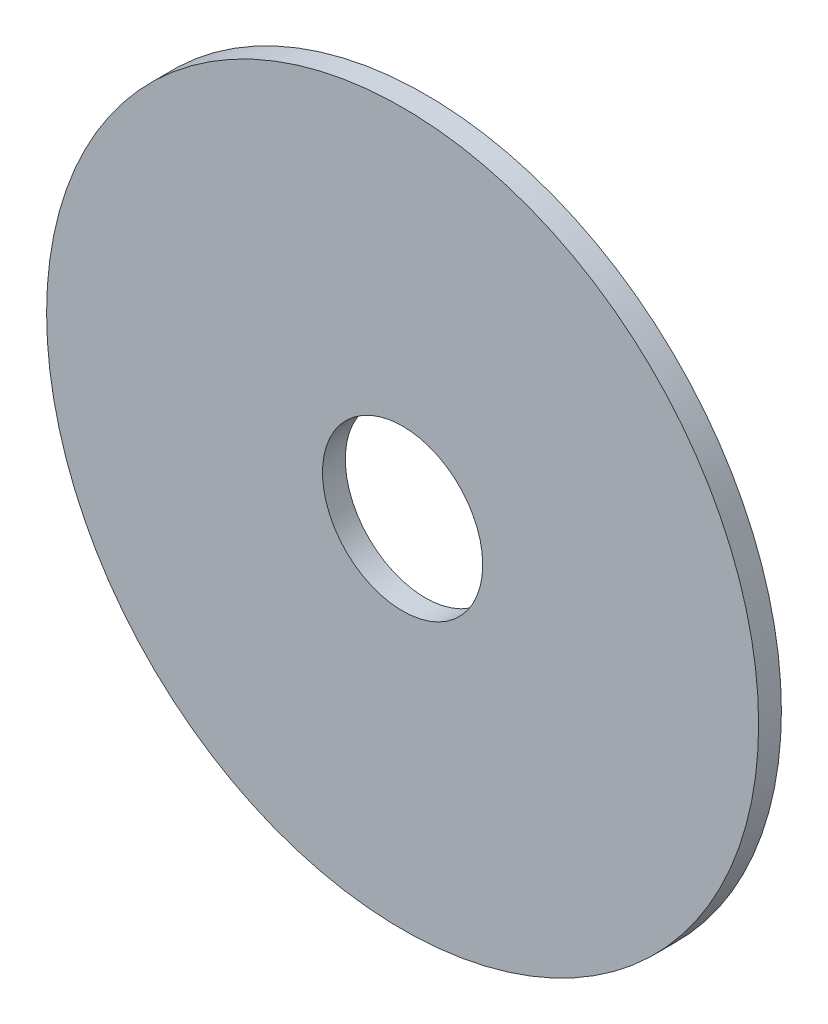
ISO-10303-21;
HEADER;
FILE_DESCRIPTION(('STEP AP214'),'2;1');
FILE_NAME('part.step','',(''),(''),'','','');
FILE_SCHEMA(('AUTOMOTIVE_DESIGN { 1 0 10303 214 1 1 1 1 }'));
ENDSEC;
DATA;
#1=APPLICATION_CONTEXT('core data for automotive mechanical design processes');
#2=APPLICATION_PROTOCOL_DEFINITION('international standard','automotive_design',2000,#1);
#3=PRODUCT_CONTEXT('',#1,'mechanical');
#4=PRODUCT('Part','Part','',(#3));
#5=PRODUCT_RELATED_PRODUCT_CATEGORY('part','',(#4));
#6=PRODUCT_DEFINITION_FORMATION('','',#4);
#7=PRODUCT_DEFINITION_CONTEXT('part definition',#1,'design');
#8=PRODUCT_DEFINITION('design','',#6,#7);
#9=PRODUCT_DEFINITION_SHAPE('','',#8);
#10=(LENGTH_UNIT() NAMED_UNIT(*) SI_UNIT(.MILLI.,.METRE.));
#11=(NAMED_UNIT(*) PLANE_ANGLE_UNIT() SI_UNIT($,.RADIAN.));
#12=(NAMED_UNIT(*) SI_UNIT($,.STERADIAN.) SOLID_ANGLE_UNIT());
#13=UNCERTAINTY_MEASURE_WITH_UNIT(LENGTH_MEASURE(1.E-05),#10,'distance_accuracy_value','');
#14=(GEOMETRIC_REPRESENTATION_CONTEXT(3) GLOBAL_UNCERTAINTY_ASSIGNED_CONTEXT((#13)) GLOBAL_UNIT_ASSIGNED_CONTEXT((#10,
#11,#12)) REPRESENTATION_CONTEXT('',''));
#15=CARTESIAN_POINT('',(0.,0.,0.));
#16=DIRECTION('',(0.,0.,1.));
#17=DIRECTION('',(1.,0.,0.));
#18=AXIS2_PLACEMENT_3D('',#15,#16,#17);
#19=CARTESIAN_POINT('',(0.,0.,-1.016));
#20=DIRECTION('',(0.,0.,1.));
#21=DIRECTION('',(1.,0.,0.));
#22=AXIS2_PLACEMENT_3D('',#19,#20,#21);
#23=CYLINDRICAL_SURFACE('',#22,15.875);
#24=CARTESIAN_POINT('',(0.,0.,-1.016));
#25=DIRECTION('',(0.,0.,1.));
#26=DIRECTION('',(1.,0.,0.));
#27=AXIS2_PLACEMENT_3D('',#24,#25,#26);
#28=CIRCLE('',#27,15.875);
#29=CARTESIAN_POINT('',(15.875,0.,-1.016));
#30=VERTEX_POINT('',#29);
#31=EDGE_CURVE('E10',#30,#30,#28,.T.);
#32=ORIENTED_EDGE('',*,*,#31,.T.);
#33=EDGE_LOOP('',(#32));
#34=FACE_BOUND('',#33,.T.);
#35=CARTESIAN_POINT('',(0.,0.,0.));
#36=DIRECTION('',(0.,0.,1.));
#37=DIRECTION('',(1.,0.,0.));
#38=AXIS2_PLACEMENT_3D('',#35,#36,#37);
#39=CIRCLE('',#38,15.875);
#40=CARTESIAN_POINT('',(15.875,0.,0.));
#41=VERTEX_POINT('',#40);
#42=EDGE_CURVE('E33',#41,#41,#39,.T.);
#43=ORIENTED_EDGE('',*,*,#42,.F.);
#44=EDGE_LOOP('',(#43));
#45=FACE_BOUND('',#44,.T.);
#46=ADVANCED_FACE('F30',(#34,#45),#23,.T.);
#47=CARTESIAN_POINT('',(0.,0.,-1.016));
#48=DIRECTION('',(0.,0.,1.));
#49=DIRECTION('',(1.,0.,0.));
#50=AXIS2_PLACEMENT_3D('',#47,#48,#49);
#51=PLANE('',#50);
#52=CARTESIAN_POINT('',(0.,0.,-1.016));
#53=DIRECTION('',(0.,0.,1.));
#54=DIRECTION('',(1.,0.,0.));
#55=AXIS2_PLACEMENT_3D('',#52,#53,#54);
#56=CIRCLE('',#55,3.571875);
#57=CARTESIAN_POINT('',(3.571875,0.,-1.016));
#58=VERTEX_POINT('',#57);
#59=EDGE_CURVE('E40',#58,#58,#56,.T.);
#60=ORIENTED_EDGE('',*,*,#59,.T.);
#61=EDGE_LOOP('',(#60));
#62=FACE_BOUND('',#61,.T.);
#63=ORIENTED_EDGE('',*,*,#31,.F.);
#64=EDGE_LOOP('',(#63));
#65=FACE_BOUND('',#64,.T.);
#66=ADVANCED_FACE('F48',(#62,#65),#51,.F.);
#67=CARTESIAN_POINT('',(0.,0.,0.));
#68=DIRECTION('',(0.,0.,1.));
#69=DIRECTION('',(1.,0.,0.));
#70=AXIS2_PLACEMENT_3D('',#67,#68,#69);
#71=PLANE('',#70);
#72=CARTESIAN_POINT('',(0.,0.,0.));
#73=DIRECTION('',(0.,0.,1.));
#74=DIRECTION('',(1.,0.,0.));
#75=AXIS2_PLACEMENT_3D('',#72,#73,#74);
#76=CIRCLE('',#75,3.571875);
#77=CARTESIAN_POINT('',(3.571875,0.,0.));
#78=VERTEX_POINT('',#77);
#79=EDGE_CURVE('E42',#78,#78,#76,.T.);
#80=ORIENTED_EDGE('',*,*,#79,.F.);
#81=EDGE_LOOP('',(#80));
#82=FACE_BOUND('',#81,.T.);
#83=ORIENTED_EDGE('',*,*,#42,.T.);
#84=EDGE_LOOP('',(#83));
#85=FACE_BOUND('',#84,.T.);
#86=ADVANCED_FACE('F54',(#82,#85),#71,.T.);
#87=CARTESIAN_POINT('',(0.,0.,-1.016));
#88=DIRECTION('',(0.,0.,1.));
#89=DIRECTION('',(1.,0.,0.));
#90=AXIS2_PLACEMENT_3D('',#87,#88,#89);
#91=CYLINDRICAL_SURFACE('',#90,3.571875);
#92=ORIENTED_EDGE('',*,*,#59,.F.);
#93=EDGE_LOOP('',(#92));
#94=FACE_BOUND('',#93,.T.);
#95=ORIENTED_EDGE('',*,*,#79,.T.);
#96=EDGE_LOOP('',(#95));
#97=FACE_BOUND('',#96,.T.);
#98=ADVANCED_FACE('F51',(#94,#97),#91,.F.);
#99=CLOSED_SHELL('',(#46,#66,#86,#98));
#100=MANIFOLD_SOLID_BREP('B2',#99);
#101=ADVANCED_BREP_SHAPE_REPRESENTATION('',(#18,#100),#14);
#102=SHAPE_DEFINITION_REPRESENTATION(#9,#101);
ENDSEC;
END-ISO-10303-21;
